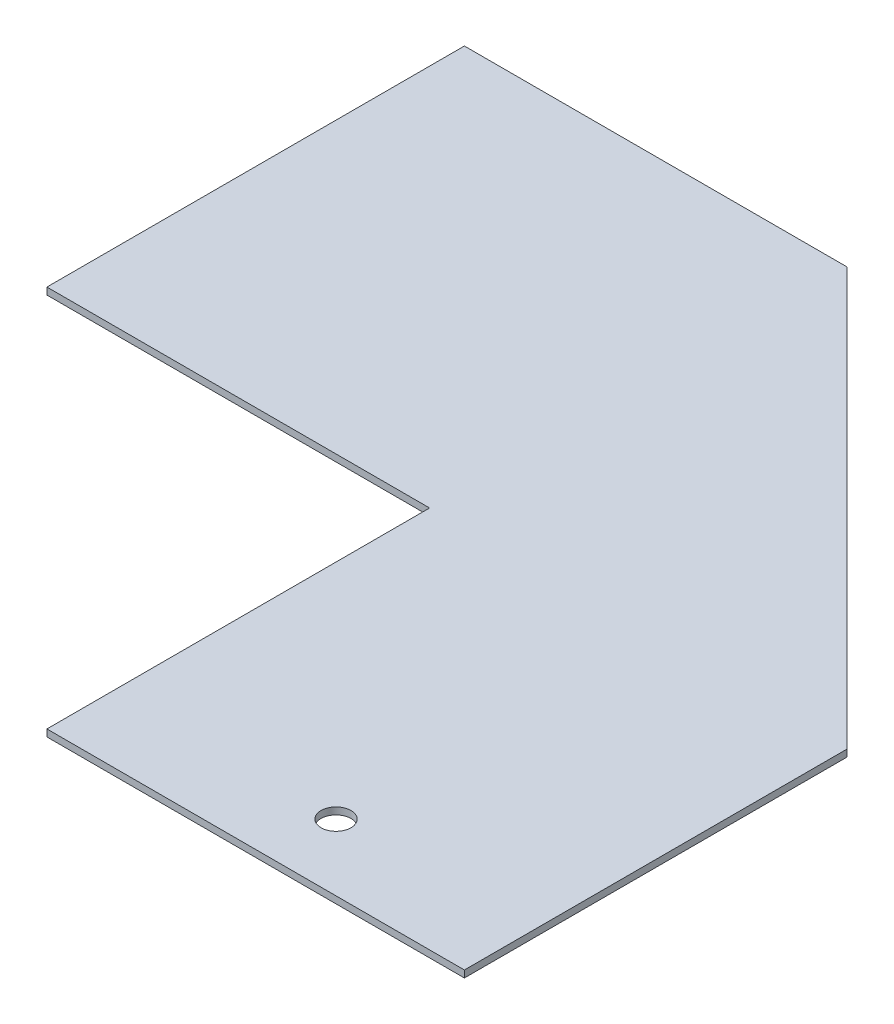
ISO-10303-21;
HEADER;
FILE_DESCRIPTION(('STEP AP214'),'2;1');
FILE_NAME('part.step','',(''),(''),'','','');
FILE_SCHEMA(('AUTOMOTIVE_DESIGN { 1 0 10303 214 1 1 1 1 }'));
ENDSEC;
DATA;
#1=APPLICATION_CONTEXT('core data for automotive mechanical design processes');
#2=APPLICATION_PROTOCOL_DEFINITION('international standard','automotive_design',2000,#1);
#3=PRODUCT_CONTEXT('',#1,'mechanical');
#4=PRODUCT('Part','Part','',(#3));
#5=PRODUCT_RELATED_PRODUCT_CATEGORY('part','',(#4));
#6=PRODUCT_DEFINITION_FORMATION('','',#4);
#7=PRODUCT_DEFINITION_CONTEXT('part definition',#1,'design');
#8=PRODUCT_DEFINITION('design','',#6,#7);
#9=PRODUCT_DEFINITION_SHAPE('','',#8);
#10=(LENGTH_UNIT() NAMED_UNIT(*) SI_UNIT(.MILLI.,.METRE.));
#11=(NAMED_UNIT(*) PLANE_ANGLE_UNIT() SI_UNIT($,.RADIAN.));
#12=(NAMED_UNIT(*) SI_UNIT($,.STERADIAN.) SOLID_ANGLE_UNIT());
#13=UNCERTAINTY_MEASURE_WITH_UNIT(LENGTH_MEASURE(1.E-05),#10,'distance_accuracy_value','');
#14=(GEOMETRIC_REPRESENTATION_CONTEXT(3) GLOBAL_UNCERTAINTY_ASSIGNED_CONTEXT((#13)) GLOBAL_UNIT_ASSIGNED_CONTEXT((#10,
#11,#12)) REPRESENTATION_CONTEXT('',''));
#15=CARTESIAN_POINT('',(0.,0.,0.));
#16=DIRECTION('',(0.,0.,1.));
#17=DIRECTION('',(1.,0.,0.));
#18=AXIS2_PLACEMENT_3D('',#15,#16,#17);
#19=CARTESIAN_POINT('',(0.,1.,0.));
#20=DIRECTION('',(0.,-1.,0.));
#21=DIRECTION('',(0.,0.,-1.));
#22=AXIS2_PLACEMENT_3D('',#19,#20,#21);
#23=PLANE('',#22);
#24=DIRECTION('',(0.,0.,1.));
#25=VECTOR('',#24,1.);
#26=CARTESIAN_POINT('',(-60.,1.,0.));
#27=LINE('',#26,#25);
#28=CARTESIAN_POINT('',(-60.,1.,0.));
#29=VERTEX_POINT('',#28);
#30=CARTESIAN_POINT('',(-60.,1.,55.));
#31=VERTEX_POINT('',#30);
#32=EDGE_CURVE('E57',#29,#31,#27,.T.);
#33=ORIENTED_EDGE('',*,*,#32,.T.);
#34=DIRECTION('',(1.,0.,0.));
#35=VECTOR('',#34,1.);
#36=CARTESIAN_POINT('',(-60.,1.,55.));
#37=LINE('',#36,#35);
#38=CARTESIAN_POINT('',(0.,1.,55.));
#39=VERTEX_POINT('',#38);
#40=EDGE_CURVE('E183',#31,#39,#37,.T.);
#41=ORIENTED_EDGE('',*,*,#40,.T.);
#42=DIRECTION('',(0.,0.,-1.));
#43=VECTOR('',#42,1.);
#44=CARTESIAN_POINT('',(0.,1.,0.));
#45=LINE('',#44,#43);
#46=CARTESIAN_POINT('',(0.,1.,0.));
#47=VERTEX_POINT('',#46);
#48=EDGE_CURVE('E116',#39,#47,#45,.T.);
#49=ORIENTED_EDGE('',*,*,#48,.T.);
#50=DIRECTION('',(-0.707106781186548,0.,-0.707106781186547));
#51=VECTOR('',#50,1.);
#52=CARTESIAN_POINT('',(-60.,1.,-60.));
#53=LINE('',#52,#51);
#54=CARTESIAN_POINT('',(-60.,1.,-60.));
#55=VERTEX_POINT('',#54);
#56=EDGE_CURVE('E164',#47,#55,#53,.T.);
#57=ORIENTED_EDGE('',*,*,#56,.T.);
#58=DIRECTION('',(-1.,0.,0.));
#59=VECTOR('',#58,1.);
#60=CARTESIAN_POINT('',(-60.,1.,-60.));
#61=LINE('',#60,#59);
#62=CARTESIAN_POINT('',(-115.,1.00000000000001,-60.));
#63=VERTEX_POINT('',#62);
#64=EDGE_CURVE('E129',#55,#63,#61,.T.);
#65=ORIENTED_EDGE('',*,*,#64,.T.);
#66=DIRECTION('',(0.,0.,1.));
#67=VECTOR('',#66,1.);
#68=CARTESIAN_POINT('',(-115.,1.00000000000001,0.));
#69=LINE('',#68,#67);
#70=CARTESIAN_POINT('',(-115.,1.00000000000001,0.));
#71=VERTEX_POINT('',#70);
#72=EDGE_CURVE('E146',#63,#71,#69,.T.);
#73=ORIENTED_EDGE('',*,*,#72,.T.);
#74=DIRECTION('',(1.,0.,0.));
#75=VECTOR('',#74,1.);
#76=CARTESIAN_POINT('',(0.,1.,0.));
#77=LINE('',#76,#75);
#78=EDGE_CURVE('E134',#71,#29,#77,.T.);
#79=ORIENTED_EDGE('',*,*,#78,.T.);
#80=EDGE_LOOP('',(#33,#41,#49,#57,#65,#73,#79));
#81=FACE_BOUND('',#80,.T.);
#82=CARTESIAN_POINT('',(-28.,1.,45.45));
#83=DIRECTION('',(0.,-1.,0.));
#84=DIRECTION('',(0.,0.,-1.));
#85=AXIS2_PLACEMENT_3D('',#82,#83,#84);
#86=CIRCLE('',#85,2.15);
#87=CARTESIAN_POINT('',(-28.,1.,43.3));
#88=VERTEX_POINT('',#87);
#89=EDGE_CURVE('E187',#88,#88,#86,.T.);
#90=ORIENTED_EDGE('',*,*,#89,.T.);
#91=EDGE_LOOP('',(#90));
#92=FACE_BOUND('',#91,.T.);
#93=ADVANCED_FACE('F54',(#81,#92),#23,.F.);
#94=CARTESIAN_POINT('',(-60.,1.,-60.));
#95=DIRECTION('',(-0.707106781186547,0.,0.707106781186548));
#96=DIRECTION('',(-0.707106781186548,0.,-0.707106781186547));
#97=AXIS2_PLACEMENT_3D('',#94,#95,#96);
#98=PLANE('',#97);
#99=DIRECTION('',(0.,1.,0.));
#100=VECTOR('',#99,1.);
#101=CARTESIAN_POINT('',(0.,1.,0.));
#102=LINE('',#101,#100);
#103=CARTESIAN_POINT('',(0.,0.,0.));
#104=VERTEX_POINT('',#103);
#105=EDGE_CURVE('E170',#104,#47,#102,.T.);
#106=ORIENTED_EDGE('',*,*,#105,.F.);
#107=DIRECTION('',(-0.707106781186548,0.,-0.707106781186547));
#108=VECTOR('',#107,1.);
#109=CARTESIAN_POINT('',(-60.,0.,-60.));
#110=LINE('',#109,#108);
#111=CARTESIAN_POINT('',(-60.,0.,-60.));
#112=VERTEX_POINT('',#111);
#113=EDGE_CURVE('E173',#104,#112,#110,.T.);
#114=ORIENTED_EDGE('',*,*,#113,.T.);
#115=DIRECTION('',(0.,1.,0.));
#116=VECTOR('',#115,1.);
#117=CARTESIAN_POINT('',(-60.,1.,-60.));
#118=LINE('',#117,#116);
#119=EDGE_CURVE('E72',#112,#55,#118,.T.);
#120=ORIENTED_EDGE('',*,*,#119,.T.);
#121=ORIENTED_EDGE('',*,*,#56,.F.);
#122=EDGE_LOOP('',(#106,#114,#120,#121));
#123=FACE_BOUND('',#122,.T.);
#124=ADVANCED_FACE('F203',(#123),#98,.F.);
#125=CARTESIAN_POINT('',(0.,1.,0.));
#126=DIRECTION('',(-1.,0.,0.));
#127=DIRECTION('',(0.,0.,-1.));
#128=AXIS2_PLACEMENT_3D('',#125,#126,#127);
#129=PLANE('',#128);
#130=ORIENTED_EDGE('',*,*,#48,.F.);
#131=DIRECTION('',(0.,1.,0.));
#132=VECTOR('',#131,1.);
#133=CARTESIAN_POINT('',(0.,1.,55.));
#134=LINE('',#133,#132);
#135=CARTESIAN_POINT('',(0.,0.,55.));
#136=VERTEX_POINT('',#135);
#137=EDGE_CURVE('E195',#136,#39,#134,.T.);
#138=ORIENTED_EDGE('',*,*,#137,.F.);
#139=DIRECTION('',(0.,0.,-1.));
#140=VECTOR('',#139,1.);
#141=CARTESIAN_POINT('',(0.,0.,0.));
#142=LINE('',#141,#140);
#143=EDGE_CURVE('E96',#136,#104,#142,.T.);
#144=ORIENTED_EDGE('',*,*,#143,.T.);
#145=ORIENTED_EDGE('',*,*,#105,.T.);
#146=EDGE_LOOP('',(#130,#138,#144,#145));
#147=FACE_BOUND('',#146,.T.);
#148=ADVANCED_FACE('F204',(#147),#129,.F.);
#149=CARTESIAN_POINT('',(-60.,1.,0.));
#150=DIRECTION('',(1.,0.,0.));
#151=DIRECTION('',(0.,0.,1.));
#152=AXIS2_PLACEMENT_3D('',#149,#150,#151);
#153=PLANE('',#152);
#154=DIRECTION('',(0.,0.,-1.));
#155=VECTOR('',#154,1.);
#156=CARTESIAN_POINT('',(-60.,0.,0.));
#157=LINE('',#156,#155);
#158=CARTESIAN_POINT('',(-60.,0.,0.));
#159=VERTEX_POINT('',#158);
#160=CARTESIAN_POINT('',(-60.,0.,55.));
#161=VERTEX_POINT('',#160);
#162=EDGE_CURVE('E169',#159,#161,#157,.F.);
#163=ORIENTED_EDGE('',*,*,#162,.T.);
#164=DIRECTION('',(0.,1.,0.));
#165=VECTOR('',#164,1.);
#166=CARTESIAN_POINT('',(-60.,1.,55.));
#167=LINE('',#166,#165);
#168=EDGE_CURVE('E175',#161,#31,#167,.T.);
#169=ORIENTED_EDGE('',*,*,#168,.T.);
#170=ORIENTED_EDGE('',*,*,#32,.F.);
#171=DIRECTION('',(0.,1.,0.));
#172=VECTOR('',#171,1.);
#173=CARTESIAN_POINT('',(-60.,1.,0.));
#174=LINE('',#173,#172);
#175=EDGE_CURVE('E64',#159,#29,#174,.T.);
#176=ORIENTED_EDGE('',*,*,#175,.F.);
#177=EDGE_LOOP('',(#163,#169,#170,#176));
#178=FACE_BOUND('',#177,.T.);
#179=ADVANCED_FACE('F206',(#178),#153,.F.);
#180=CARTESIAN_POINT('',(0.,1.,0.));
#181=DIRECTION('',(0.,0.,-1.));
#182=DIRECTION('',(1.,0.,0.));
#183=AXIS2_PLACEMENT_3D('',#180,#181,#182);
#184=PLANE('',#183);
#185=ORIENTED_EDGE('',*,*,#78,.F.);
#186=DIRECTION('',(0.,1.,0.));
#187=VECTOR('',#186,1.);
#188=CARTESIAN_POINT('',(-115.,1.00000000000001,0.));
#189=LINE('',#188,#187);
#190=CARTESIAN_POINT('',(-115.,0.,0.));
#191=VERTEX_POINT('',#190);
#192=EDGE_CURVE('E137',#191,#71,#189,.T.);
#193=ORIENTED_EDGE('',*,*,#192,.F.);
#194=DIRECTION('',(1.,0.,0.));
#195=VECTOR('',#194,1.);
#196=CARTESIAN_POINT('',(0.,0.,0.));
#197=LINE('',#196,#195);
#198=EDGE_CURVE('E123',#191,#159,#197,.T.);
#199=ORIENTED_EDGE('',*,*,#198,.T.);
#200=ORIENTED_EDGE('',*,*,#175,.T.);
#201=EDGE_LOOP('',(#185,#193,#199,#200));
#202=FACE_BOUND('',#201,.T.);
#203=ADVANCED_FACE('F136',(#202),#184,.F.);
#204=CARTESIAN_POINT('',(0.,0.,0.));
#205=DIRECTION('',(0.,-1.,0.));
#206=DIRECTION('',(0.,0.,-1.));
#207=AXIS2_PLACEMENT_3D('',#204,#205,#206);
#208=PLANE('',#207);
#209=ORIENTED_EDGE('',*,*,#143,.F.);
#210=DIRECTION('',(1.,0.,0.));
#211=VECTOR('',#210,1.);
#212=CARTESIAN_POINT('',(0.,0.,55.));
#213=LINE('',#212,#211);
#214=EDGE_CURVE('E154',#161,#136,#213,.T.);
#215=ORIENTED_EDGE('',*,*,#214,.F.);
#216=ORIENTED_EDGE('',*,*,#162,.F.);
#217=ORIENTED_EDGE('',*,*,#198,.F.);
#218=DIRECTION('',(0.,0.,-1.));
#219=VECTOR('',#218,1.);
#220=CARTESIAN_POINT('',(-115.,0.,0.));
#221=LINE('',#220,#219);
#222=CARTESIAN_POINT('',(-115.,0.,-60.));
#223=VERTEX_POINT('',#222);
#224=EDGE_CURVE('E147',#223,#191,#221,.F.);
#225=ORIENTED_EDGE('',*,*,#224,.F.);
#226=DIRECTION('',(1.,0.,0.));
#227=VECTOR('',#226,1.);
#228=CARTESIAN_POINT('',(0.,0.,-60.));
#229=LINE('',#228,#227);
#230=EDGE_CURVE('E13',#112,#223,#229,.F.);
#231=ORIENTED_EDGE('',*,*,#230,.F.);
#232=ORIENTED_EDGE('',*,*,#113,.F.);
#233=EDGE_LOOP('',(#209,#215,#216,#217,#225,#231,#232));
#234=FACE_BOUND('',#233,.T.);
#235=CARTESIAN_POINT('',(-28.,-1.56992474575901E-13,45.45));
#236=DIRECTION('',(0.,-1.,0.));
#237=DIRECTION('',(1.,0.,0.));
#238=AXIS2_PLACEMENT_3D('',#235,#236,#237);
#239=CIRCLE('',#238,2.15);
#240=CARTESIAN_POINT('',(-25.85,-1.56992474575901E-13,45.45));
#241=VERTEX_POINT('',#240);
#242=EDGE_CURVE('E192',#241,#241,#239,.T.);
#243=ORIENTED_EDGE('',*,*,#242,.F.);
#244=EDGE_LOOP('',(#243));
#245=FACE_BOUND('',#244,.T.);
#246=ADVANCED_FACE('F201',(#234,#245),#208,.T.);
#247=CARTESIAN_POINT('',(-60.,1.,-60.));
#248=DIRECTION('',(0.,0.,1.));
#249=DIRECTION('',(-1.,0.,0.));
#250=AXIS2_PLACEMENT_3D('',#247,#248,#249);
#251=PLANE('',#250);
#252=ORIENTED_EDGE('',*,*,#230,.T.);
#253=DIRECTION('',(0.,1.,0.));
#254=VECTOR('',#253,1.);
#255=CARTESIAN_POINT('',(-115.,1.00000000000001,-60.));
#256=LINE('',#255,#254);
#257=EDGE_CURVE('E151',#223,#63,#256,.T.);
#258=ORIENTED_EDGE('',*,*,#257,.T.);
#259=ORIENTED_EDGE('',*,*,#64,.F.);
#260=ORIENTED_EDGE('',*,*,#119,.F.);
#261=EDGE_LOOP('',(#252,#258,#259,#260));
#262=FACE_BOUND('',#261,.T.);
#263=ADVANCED_FACE('F200',(#262),#251,.F.);
#264=CARTESIAN_POINT('',(-60.,1.,55.));
#265=DIRECTION('',(0.,0.,-1.));
#266=DIRECTION('',(1.,0.,0.));
#267=AXIS2_PLACEMENT_3D('',#264,#265,#266);
#268=PLANE('',#267);
#269=ORIENTED_EDGE('',*,*,#168,.F.);
#270=ORIENTED_EDGE('',*,*,#214,.T.);
#271=ORIENTED_EDGE('',*,*,#137,.T.);
#272=ORIENTED_EDGE('',*,*,#40,.F.);
#273=EDGE_LOOP('',(#269,#270,#271,#272));
#274=FACE_BOUND('',#273,.T.);
#275=ADVANCED_FACE('F261',(#274),#268,.F.);
#276=CARTESIAN_POINT('',(-28.,9.99999999999984,45.45));
#277=DIRECTION('',(0.,-1.,0.));
#278=DIRECTION('',(1.,0.,0.));
#279=AXIS2_PLACEMENT_3D('',#276,#277,#278);
#280=CYLINDRICAL_SURFACE('',#279,2.15);
#281=ORIENTED_EDGE('',*,*,#242,.T.);
#282=EDGE_LOOP('',(#281));
#283=FACE_BOUND('',#282,.T.);
#284=ORIENTED_EDGE('',*,*,#89,.F.);
#285=EDGE_LOOP('',(#284));
#286=FACE_BOUND('',#285,.T.);
#287=ADVANCED_FACE('F270',(#283,#286),#280,.F.);
#288=CARTESIAN_POINT('',(-115.,1.00000000000001,0.));
#289=DIRECTION('',(1.,0.,0.));
#290=DIRECTION('',(0.,0.,1.));
#291=AXIS2_PLACEMENT_3D('',#288,#289,#290);
#292=PLANE('',#291);
#293=ORIENTED_EDGE('',*,*,#257,.F.);
#294=ORIENTED_EDGE('',*,*,#224,.T.);
#295=ORIENTED_EDGE('',*,*,#192,.T.);
#296=ORIENTED_EDGE('',*,*,#72,.F.);
#297=EDGE_LOOP('',(#293,#294,#295,#296));
#298=FACE_BOUND('',#297,.T.);
#299=ADVANCED_FACE('F145',(#298),#292,.F.);
#300=CLOSED_SHELL('',(#93,#124,#148,#179,#203,#246,#263,#275,#287,#299));
#301=MANIFOLD_SOLID_BREP('B2',#300);
#302=ADVANCED_BREP_SHAPE_REPRESENTATION('',(#18,#301),#14);
#303=SHAPE_DEFINITION_REPRESENTATION(#9,#302);
ENDSEC;
END-ISO-10303-21;
